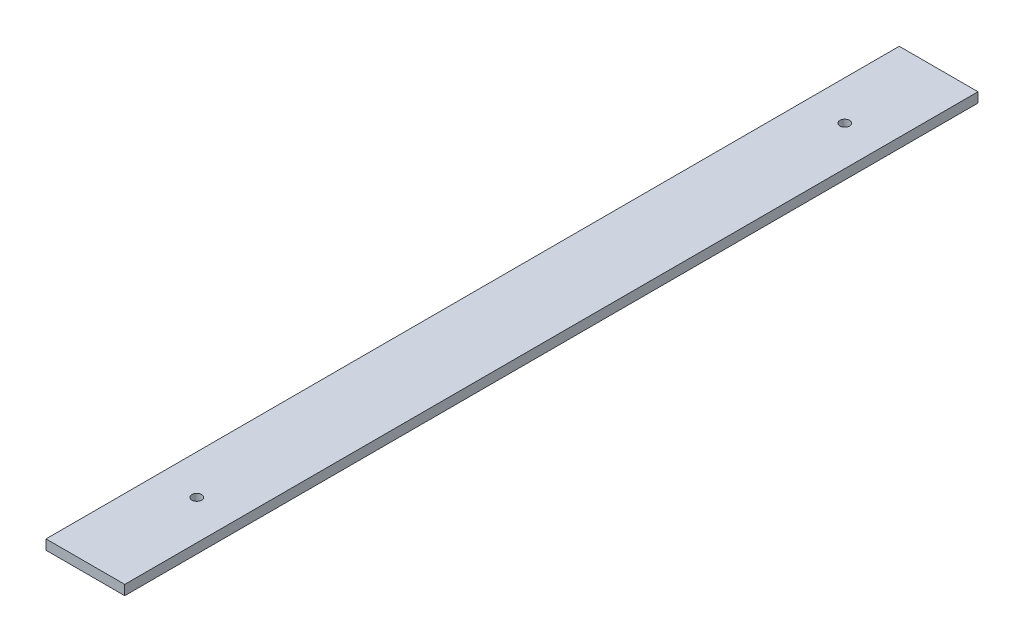
ISO-10303-21;
HEADER;
FILE_DESCRIPTION(('STEP AP214'),'2;1');
FILE_NAME('part.step','',(''),(''),'','','');
FILE_SCHEMA(('AUTOMOTIVE_DESIGN { 1 0 10303 214 1 1 1 1 }'));
ENDSEC;
DATA;
#1=APPLICATION_CONTEXT('core data for automotive mechanical design processes');
#2=APPLICATION_PROTOCOL_DEFINITION('international standard','automotive_design',2000,#1);
#3=PRODUCT_CONTEXT('',#1,'mechanical');
#4=PRODUCT('Part','Part','',(#3));
#5=PRODUCT_RELATED_PRODUCT_CATEGORY('part','',(#4));
#6=PRODUCT_DEFINITION_FORMATION('','',#4);
#7=PRODUCT_DEFINITION_CONTEXT('part definition',#1,'design');
#8=PRODUCT_DEFINITION('design','',#6,#7);
#9=PRODUCT_DEFINITION_SHAPE('','',#8);
#10=(LENGTH_UNIT() NAMED_UNIT(*) SI_UNIT(.MILLI.,.METRE.));
#11=(NAMED_UNIT(*) PLANE_ANGLE_UNIT() SI_UNIT($,.RADIAN.));
#12=(NAMED_UNIT(*) SI_UNIT($,.STERADIAN.) SOLID_ANGLE_UNIT());
#13=UNCERTAINTY_MEASURE_WITH_UNIT(LENGTH_MEASURE(1.E-05),#10,'distance_accuracy_value','');
#14=(GEOMETRIC_REPRESENTATION_CONTEXT(3) GLOBAL_UNCERTAINTY_ASSIGNED_CONTEXT((#13)) GLOBAL_UNIT_ASSIGNED_CONTEXT((#10,
#11,#12)) REPRESENTATION_CONTEXT('',''));
#15=CARTESIAN_POINT('',(0.,0.,0.));
#16=DIRECTION('',(0.,0.,1.));
#17=DIRECTION('',(1.,0.,0.));
#18=AXIS2_PLACEMENT_3D('',#15,#16,#17);
#19=CARTESIAN_POINT('',(0.,25.,0.));
#20=DIRECTION('',(0.,-1.,0.));
#21=DIRECTION('',(0.,0.,-1.));
#22=AXIS2_PLACEMENT_3D('',#19,#20,#21);
#23=PLANE('',#22);
#24=DIRECTION('',(0.,0.,-1.));
#25=VECTOR('',#24,1.);
#26=CARTESIAN_POINT('',(19732.9446458133,25.,9942.5828739722));
#27=LINE('',#26,#25);
#28=CARTESIAN_POINT('',(19732.9446458133,25.,12109.8435727021));
#29=VERTEX_POINT('',#28);
#30=CARTESIAN_POINT('',(19732.9446458133,25.,9942.5828739722));
#31=VERTEX_POINT('',#30);
#32=EDGE_CURVE('E102',#29,#31,#27,.T.);
#33=ORIENTED_EDGE('',*,*,#32,.T.);
#34=DIRECTION('',(-1.,0.,0.));
#35=VECTOR('',#34,1.);
#36=CARTESIAN_POINT('',(19732.9446458133,25.,9942.5828739722));
#37=LINE('',#36,#35);
#38=CARTESIAN_POINT('',(19532.9446458133,25.,9942.5828739722));
#39=VERTEX_POINT('',#38);
#40=EDGE_CURVE('E97',#31,#39,#37,.T.);
#41=ORIENTED_EDGE('',*,*,#40,.T.);
#42=DIRECTION('',(0.,0.,1.));
#43=VECTOR('',#42,1.);
#44=CARTESIAN_POINT('',(19532.9446458133,25.,9942.5828739722));
#45=LINE('',#44,#43);
#46=CARTESIAN_POINT('',(19532.9446458133,25.,12109.8435727021));
#47=VERTEX_POINT('',#46);
#48=EDGE_CURVE('E100',#39,#47,#45,.T.);
#49=ORIENTED_EDGE('',*,*,#48,.T.);
#50=DIRECTION('',(1.,0.,0.));
#51=VECTOR('',#50,1.);
#52=CARTESIAN_POINT('',(19732.9446458133,25.,12109.8435727021));
#53=LINE('',#52,#51);
#54=EDGE_CURVE('E67',#47,#29,#53,.T.);
#55=ORIENTED_EDGE('',*,*,#54,.T.);
#56=EDGE_LOOP('',(#33,#41,#49,#55));
#57=FACE_BOUND('',#56,.T.);
#58=CARTESIAN_POINT('',(19632.9446458133,25.,11826.9154481533));
#59=DIRECTION('',(0.,1.,0.));
#60=DIRECTION('',(0.,0.,1.));
#61=AXIS2_PLACEMENT_3D('',#58,#59,#60);
#62=CIRCLE('',#61,12.4999999999988);
#63=CARTESIAN_POINT('',(19632.9446458133,25.,11839.4154481533));
#64=VERTEX_POINT('',#63);
#65=EDGE_CURVE('E117',#64,#64,#62,.T.);
#66=ORIENTED_EDGE('',*,*,#65,.F.);
#67=EDGE_LOOP('',(#66));
#68=FACE_BOUND('',#67,.T.);
#69=CARTESIAN_POINT('',(19632.9446458133,25.,10181.0304593336));
#70=DIRECTION('',(0.,1.,0.));
#71=DIRECTION('',(0.,0.,1.));
#72=AXIS2_PLACEMENT_3D('',#69,#70,#71);
#73=CIRCLE('',#72,12.4999999999988);
#74=CARTESIAN_POINT('',(19632.9446458133,25.,10193.5304593336));
#75=VERTEX_POINT('',#74);
#76=EDGE_CURVE('E132',#75,#75,#73,.T.);
#77=ORIENTED_EDGE('',*,*,#76,.F.);
#78=EDGE_LOOP('',(#77));
#79=FACE_BOUND('',#78,.T.);
#80=ADVANCED_FACE('F50',(#57,#68,#79),#23,.F.);
#81=CARTESIAN_POINT('',(0.,0.,0.));
#82=DIRECTION('',(0.,-1.,0.));
#83=DIRECTION('',(0.,0.,-1.));
#84=AXIS2_PLACEMENT_3D('',#81,#82,#83);
#85=PLANE('',#84);
#86=CARTESIAN_POINT('',(19632.9446458133,0.,11826.9154481533));
#87=DIRECTION('',(0.,1.,0.));
#88=DIRECTION('',(0.,0.,1.));
#89=AXIS2_PLACEMENT_3D('',#86,#87,#88);
#90=CIRCLE('',#89,12.4999999999988);
#91=CARTESIAN_POINT('',(19632.9446458133,0.,11839.4154481533));
#92=VERTEX_POINT('',#91);
#93=EDGE_CURVE('E129',#92,#92,#90,.T.);
#94=ORIENTED_EDGE('',*,*,#93,.T.);
#95=EDGE_LOOP('',(#94));
#96=FACE_BOUND('',#95,.T.);
#97=DIRECTION('',(0.,0.,-1.));
#98=VECTOR('',#97,1.);
#99=CARTESIAN_POINT('',(19732.9446458133,0.,9942.5828739722));
#100=LINE('',#99,#98);
#101=CARTESIAN_POINT('',(19732.9446458133,0.,12109.8435727021));
#102=VERTEX_POINT('',#101);
#103=CARTESIAN_POINT('',(19732.9446458133,0.,9942.5828739722));
#104=VERTEX_POINT('',#103);
#105=EDGE_CURVE('E114',#102,#104,#100,.T.);
#106=ORIENTED_EDGE('',*,*,#105,.F.);
#107=DIRECTION('',(1.,0.,0.));
#108=VECTOR('',#107,1.);
#109=CARTESIAN_POINT('',(19732.9446458133,0.,12109.8435727021));
#110=LINE('',#109,#108);
#111=CARTESIAN_POINT('',(19532.9446458133,0.,12109.8435727021));
#112=VERTEX_POINT('',#111);
#113=EDGE_CURVE('E90',#112,#102,#110,.T.);
#114=ORIENTED_EDGE('',*,*,#113,.F.);
#115=DIRECTION('',(0.,0.,1.));
#116=VECTOR('',#115,1.);
#117=CARTESIAN_POINT('',(19532.9446458133,0.,9942.5828739722));
#118=LINE('',#117,#116);
#119=CARTESIAN_POINT('',(19532.9446458133,0.,9942.5828739722));
#120=VERTEX_POINT('',#119);
#121=EDGE_CURVE('E84',#120,#112,#118,.T.);
#122=ORIENTED_EDGE('',*,*,#121,.F.);
#123=DIRECTION('',(-1.,0.,0.));
#124=VECTOR('',#123,1.);
#125=CARTESIAN_POINT('',(19732.9446458133,0.,9942.5828739722));
#126=LINE('',#125,#124);
#127=EDGE_CURVE('E106',#104,#120,#126,.T.);
#128=ORIENTED_EDGE('',*,*,#127,.F.);
#129=EDGE_LOOP('',(#106,#114,#122,#128));
#130=FACE_BOUND('',#129,.T.);
#131=CARTESIAN_POINT('',(19632.9446458133,0.,10181.0304593336));
#132=DIRECTION('',(0.,1.,0.));
#133=DIRECTION('',(0.,0.,1.));
#134=AXIS2_PLACEMENT_3D('',#131,#132,#133);
#135=CIRCLE('',#134,12.4999999999988);
#136=CARTESIAN_POINT('',(19632.9446458133,0.,10193.5304593336));
#137=VERTEX_POINT('',#136);
#138=EDGE_CURVE('E135',#137,#137,#135,.T.);
#139=ORIENTED_EDGE('',*,*,#138,.T.);
#140=EDGE_LOOP('',(#139));
#141=FACE_BOUND('',#140,.T.);
#142=ADVANCED_FACE('F125',(#96,#130,#141),#85,.T.);
#143=CARTESIAN_POINT('',(19732.9446458133,25.,9942.5828739722));
#144=DIRECTION('',(-1.,0.,0.));
#145=DIRECTION('',(0.,0.,1.));
#146=AXIS2_PLACEMENT_3D('',#143,#144,#145);
#147=PLANE('',#146);
#148=ORIENTED_EDGE('',*,*,#105,.T.);
#149=DIRECTION('',(0.,-1.,0.));
#150=VECTOR('',#149,1.);
#151=CARTESIAN_POINT('',(19732.9446458133,25.,9942.5828739722));
#152=LINE('',#151,#150);
#153=EDGE_CURVE('E13',#31,#104,#152,.T.);
#154=ORIENTED_EDGE('',*,*,#153,.F.);
#155=ORIENTED_EDGE('',*,*,#32,.F.);
#156=DIRECTION('',(0.,-1.,0.));
#157=VECTOR('',#156,1.);
#158=CARTESIAN_POINT('',(19732.9446458133,25.,12109.8435727021));
#159=LINE('',#158,#157);
#160=EDGE_CURVE('E110',#29,#102,#159,.T.);
#161=ORIENTED_EDGE('',*,*,#160,.T.);
#162=EDGE_LOOP('',(#148,#154,#155,#161));
#163=FACE_BOUND('',#162,.T.);
#164=ADVANCED_FACE('F52',(#163),#147,.F.);
#165=CARTESIAN_POINT('',(19732.9446458133,25.,9942.5828739722));
#166=DIRECTION('',(0.,0.,1.));
#167=DIRECTION('',(1.,0.,0.));
#168=AXIS2_PLACEMENT_3D('',#165,#166,#167);
#169=PLANE('',#168);
#170=ORIENTED_EDGE('',*,*,#127,.T.);
#171=DIRECTION('',(0.,-1.,0.));
#172=VECTOR('',#171,1.);
#173=CARTESIAN_POINT('',(19532.9446458133,25.,9942.5828739722));
#174=LINE('',#173,#172);
#175=EDGE_CURVE('E59',#39,#120,#174,.T.);
#176=ORIENTED_EDGE('',*,*,#175,.F.);
#177=ORIENTED_EDGE('',*,*,#40,.F.);
#178=ORIENTED_EDGE('',*,*,#153,.T.);
#179=EDGE_LOOP('',(#170,#176,#177,#178));
#180=FACE_BOUND('',#179,.T.);
#181=ADVANCED_FACE('F105',(#180),#169,.F.);
#182=CARTESIAN_POINT('',(19532.9446458133,25.,9942.5828739722));
#183=DIRECTION('',(1.,0.,0.));
#184=DIRECTION('',(0.,0.,-1.));
#185=AXIS2_PLACEMENT_3D('',#182,#183,#184);
#186=PLANE('',#185);
#187=ORIENTED_EDGE('',*,*,#121,.T.);
#188=DIRECTION('',(0.,-1.,0.));
#189=VECTOR('',#188,1.);
#190=CARTESIAN_POINT('',(19532.9446458133,25.,12109.8435727021));
#191=LINE('',#190,#189);
#192=EDGE_CURVE('E107',#47,#112,#191,.T.);
#193=ORIENTED_EDGE('',*,*,#192,.F.);
#194=ORIENTED_EDGE('',*,*,#48,.F.);
#195=ORIENTED_EDGE('',*,*,#175,.T.);
#196=EDGE_LOOP('',(#187,#193,#194,#195));
#197=FACE_BOUND('',#196,.T.);
#198=ADVANCED_FACE('F108',(#197),#186,.F.);
#199=CARTESIAN_POINT('',(19732.9446458133,25.,12109.8435727021));
#200=DIRECTION('',(0.,0.,-1.));
#201=DIRECTION('',(-1.,0.,0.));
#202=AXIS2_PLACEMENT_3D('',#199,#200,#201);
#203=PLANE('',#202);
#204=ORIENTED_EDGE('',*,*,#113,.T.);
#205=ORIENTED_EDGE('',*,*,#160,.F.);
#206=ORIENTED_EDGE('',*,*,#54,.F.);
#207=ORIENTED_EDGE('',*,*,#192,.T.);
#208=EDGE_LOOP('',(#204,#205,#206,#207));
#209=FACE_BOUND('',#208,.T.);
#210=ADVANCED_FACE('F122',(#209),#203,.F.);
#211=CARTESIAN_POINT('',(19632.9446458133,25.,11826.9154481533));
#212=DIRECTION('',(0.,-1.,0.));
#213=DIRECTION('',(0.,0.,-1.));
#214=AXIS2_PLACEMENT_3D('',#211,#212,#213);
#215=CYLINDRICAL_SURFACE('',#214,12.4999999999988);
#216=ORIENTED_EDGE('',*,*,#65,.T.);
#217=EDGE_LOOP('',(#216));
#218=FACE_BOUND('',#217,.T.);
#219=ORIENTED_EDGE('',*,*,#93,.F.);
#220=EDGE_LOOP('',(#219));
#221=FACE_BOUND('',#220,.T.);
#222=ADVANCED_FACE('F152',(#218,#221),#215,.F.);
#223=CARTESIAN_POINT('',(19632.9446458133,25.,10181.0304593336));
#224=DIRECTION('',(0.,-1.,0.));
#225=DIRECTION('',(0.,0.,-1.));
#226=AXIS2_PLACEMENT_3D('',#223,#224,#225);
#227=CYLINDRICAL_SURFACE('',#226,12.4999999999988);
#228=ORIENTED_EDGE('',*,*,#76,.T.);
#229=EDGE_LOOP('',(#228));
#230=FACE_BOUND('',#229,.T.);
#231=ORIENTED_EDGE('',*,*,#138,.F.);
#232=EDGE_LOOP('',(#231));
#233=FACE_BOUND('',#232,.T.);
#234=ADVANCED_FACE('F141',(#230,#233),#227,.F.);
#235=CLOSED_SHELL('',(#80,#142,#164,#181,#198,#210,#222,#234));
#236=MANIFOLD_SOLID_BREP('B2',#235);
#237=ADVANCED_BREP_SHAPE_REPRESENTATION('',(#18,#236),#14);
#238=SHAPE_DEFINITION_REPRESENTATION(#9,#237);
ENDSEC;
END-ISO-10303-21;
